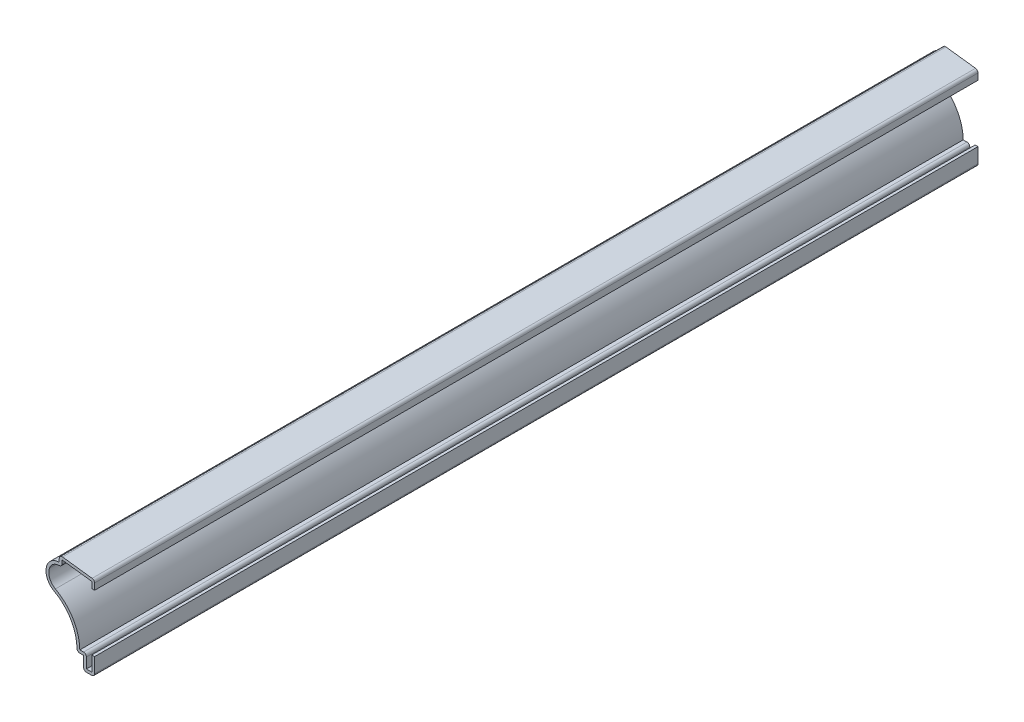
ISO-10303-21;
HEADER;
FILE_DESCRIPTION(('STEP AP214'),'2;1');
FILE_NAME('part.step','',(''),(''),'','','');
FILE_SCHEMA(('AUTOMOTIVE_DESIGN { 1 0 10303 214 1 1 1 1 }'));
ENDSEC;
DATA;
#1=APPLICATION_CONTEXT('core data for automotive mechanical design processes');
#2=APPLICATION_PROTOCOL_DEFINITION('international standard','automotive_design',2000,#1);
#3=PRODUCT_CONTEXT('',#1,'mechanical');
#4=PRODUCT('Part','Part','',(#3));
#5=PRODUCT_RELATED_PRODUCT_CATEGORY('part','',(#4));
#6=PRODUCT_DEFINITION_FORMATION('','',#4);
#7=PRODUCT_DEFINITION_CONTEXT('part definition',#1,'design');
#8=PRODUCT_DEFINITION('design','',#6,#7);
#9=PRODUCT_DEFINITION_SHAPE('','',#8);
#10=(LENGTH_UNIT() NAMED_UNIT(*) SI_UNIT(.MILLI.,.METRE.));
#11=(NAMED_UNIT(*) PLANE_ANGLE_UNIT() SI_UNIT($,.RADIAN.));
#12=(NAMED_UNIT(*) SI_UNIT($,.STERADIAN.) SOLID_ANGLE_UNIT());
#13=UNCERTAINTY_MEASURE_WITH_UNIT(LENGTH_MEASURE(1.E-05),#10,'distance_accuracy_value','');
#14=(GEOMETRIC_REPRESENTATION_CONTEXT(3) GLOBAL_UNCERTAINTY_ASSIGNED_CONTEXT((#13)) GLOBAL_UNIT_ASSIGNED_CONTEXT((#10,
#11,#12)) REPRESENTATION_CONTEXT('',''));
#15=CARTESIAN_POINT('',(0.,0.,0.));
#16=DIRECTION('',(0.,0.,1.));
#17=DIRECTION('',(1.,0.,0.));
#18=AXIS2_PLACEMENT_3D('',#15,#16,#17);
#19=CARTESIAN_POINT('',(-1.016,30.1625,-317.5));
#20=DIRECTION('',(-1.,0.,0.));
#21=DIRECTION('',(0.,-1.,0.));
#22=AXIS2_PLACEMENT_3D('',#19,#20,#21);
#23=PLANE('',#22);
#24=DIRECTION('',(0.,-1.,0.));
#25=VECTOR('',#24,1.);
#26=CARTESIAN_POINT('',(-1.016,30.1625,0.));
#27=LINE('',#26,#25);
#28=CARTESIAN_POINT('',(-1.016,29.2655932659661,0.));
#29=VERTEX_POINT('',#28);
#30=CARTESIAN_POINT('',(-1.016,26.9875,0.));
#31=VERTEX_POINT('',#30);
#32=EDGE_CURVE('E305',#29,#31,#27,.T.);
#33=ORIENTED_EDGE('',*,*,#32,.F.);
#34=DIRECTION('',(0.,0.,1.));
#35=VECTOR('',#34,1.);
#36=CARTESIAN_POINT('',(-1.016,29.2655932659661,-317.5));
#37=LINE('',#36,#35);
#38=CARTESIAN_POINT('',(-1.016,29.2655932659661,-317.5));
#39=VERTEX_POINT('',#38);
#40=EDGE_CURVE('E251',#39,#29,#37,.T.);
#41=ORIENTED_EDGE('',*,*,#40,.F.);
#42=DIRECTION('',(0.,-1.,0.));
#43=VECTOR('',#42,1.);
#44=CARTESIAN_POINT('',(-1.016,30.1625,-317.5));
#45=LINE('',#44,#43);
#46=CARTESIAN_POINT('',(-1.016,26.9875,-317.5));
#47=VERTEX_POINT('',#46);
#48=EDGE_CURVE('E233',#39,#47,#45,.T.);
#49=ORIENTED_EDGE('',*,*,#48,.T.);
#50=DIRECTION('',(0.,0.,1.));
#51=VECTOR('',#50,1.);
#52=CARTESIAN_POINT('',(-1.016,26.9875,-317.5));
#53=LINE('',#52,#51);
#54=EDGE_CURVE('E241',#47,#31,#53,.T.);
#55=ORIENTED_EDGE('',*,*,#54,.T.);
#56=EDGE_LOOP('',(#33,#41,#49,#55));
#57=FACE_BOUND('',#56,.T.);
#58=ADVANCED_FACE('F35',(#57),#23,.T.);
#59=CARTESIAN_POINT('',(-12.8260192903426,30.7418456772589,-317.5));
#60=DIRECTION('',(-0.124034734589208,-0.992277876713668,0.));
#61=DIRECTION('',(0.992277876713668,-0.124034734589208,0.));
#62=AXIS2_PLACEMENT_3D('',#59,#60,#61);
#63=PLANE('',#62);
#64=DIRECTION('',(0.992277876713668,-0.124034734589208,0.));
#65=VECTOR('',#64,1.);
#66=CARTESIAN_POINT('',(-12.8260192903426,30.7418456772589,0.));
#67=LINE('',#66,#65);
#68=CARTESIAN_POINT('',(-11.684,30.5990932659661,0.));
#69=VERTEX_POINT('',#68);
#70=EDGE_CURVE('E252',#69,#29,#67,.T.);
#71=ORIENTED_EDGE('',*,*,#70,.F.);
#72=DIRECTION('',(0.,0.,1.));
#73=VECTOR('',#72,1.);
#74=CARTESIAN_POINT('',(-11.684,30.5990932659661,-317.5));
#75=LINE('',#74,#73);
#76=CARTESIAN_POINT('',(-11.684,30.5990932659661,-317.5));
#77=VERTEX_POINT('',#76);
#78=EDGE_CURVE('E357',#77,#69,#75,.T.);
#79=ORIENTED_EDGE('',*,*,#78,.F.);
#80=DIRECTION('',(0.992277876713668,-0.124034734589208,0.));
#81=VECTOR('',#80,1.);
#82=CARTESIAN_POINT('',(-12.8260192903426,30.7418456772589,-317.5));
#83=LINE('',#82,#81);
#84=EDGE_CURVE('E249',#77,#39,#83,.T.);
#85=ORIENTED_EDGE('',*,*,#84,.T.);
#86=ORIENTED_EDGE('',*,*,#40,.T.);
#87=EDGE_LOOP('',(#71,#79,#85,#86));
#88=FACE_BOUND('',#87,.T.);
#89=ADVANCED_FACE('F468',(#88),#63,.T.);
#90=CARTESIAN_POINT('',(-11.684,29.36875,-317.5));
#91=DIRECTION('',(1.,0.,0.));
#92=DIRECTION('',(0.,1.,0.));
#93=AXIS2_PLACEMENT_3D('',#90,#91,#92);
#94=PLANE('',#93);
#95=DIRECTION('',(0.,1.,0.));
#96=VECTOR('',#95,1.);
#97=CARTESIAN_POINT('',(-11.684,29.36875,0.));
#98=LINE('',#97,#96);
#99=CARTESIAN_POINT('',(-11.684,29.36875,0.));
#100=VERTEX_POINT('',#99);
#101=EDGE_CURVE('E255',#100,#69,#98,.T.);
#102=ORIENTED_EDGE('',*,*,#101,.F.);
#103=DIRECTION('',(0.,0.,1.));
#104=VECTOR('',#103,1.);
#105=CARTESIAN_POINT('',(-11.684,29.36875,-317.5));
#106=LINE('',#105,#104);
#107=CARTESIAN_POINT('',(-11.684,29.36875,-317.5));
#108=VERTEX_POINT('',#107);
#109=EDGE_CURVE('E438',#100,#108,#106,.F.);
#110=ORIENTED_EDGE('',*,*,#109,.T.);
#111=DIRECTION('',(0.,1.,0.));
#112=VECTOR('',#111,1.);
#113=CARTESIAN_POINT('',(-11.684,29.36875,-317.5));
#114=LINE('',#113,#112);
#115=EDGE_CURVE('E302',#108,#77,#114,.T.);
#116=ORIENTED_EDGE('',*,*,#115,.T.);
#117=ORIENTED_EDGE('',*,*,#78,.T.);
#118=EDGE_LOOP('',(#102,#110,#116,#117));
#119=FACE_BOUND('',#118,.T.);
#120=ADVANCED_FACE('F570',(#119),#94,.T.);
#121=CARTESIAN_POINT('',(-12.6576725735811,24.6064380993605,-317.5));
#122=DIRECTION('',(0.,0.,1.));
#123=DIRECTION('',(1.,0.,0.));
#124=AXIS2_PLACEMENT_3D('',#121,#122,#123);
#125=CYLINDRICAL_SURFACE('',#124,3.7465);
#126=CARTESIAN_POINT('',(-12.6576725735811,24.6064380993605,-317.5));
#127=DIRECTION('',(0.,0.,1.));
#128=DIRECTION('',(1.,0.,0.));
#129=AXIS2_PLACEMENT_3D('',#126,#127,#128);
#130=CIRCLE('',#129,3.7465);
#131=CARTESIAN_POINT('',(-16.2043871208838,25.8135330293272,-317.5));
#132=VERTEX_POINT('',#131);
#133=CARTESIAN_POINT('',(-12.6909701490306,28.3527901278636,-317.5));
#134=VERTEX_POINT('',#133);
#135=EDGE_CURVE('E299',#132,#134,#130,.F.);
#136=ORIENTED_EDGE('',*,*,#135,.T.);
#137=DIRECTION('',(0.,0.,1.));
#138=VECTOR('',#137,1.);
#139=CARTESIAN_POINT('',(-12.6909701490306,28.3527901278636,-317.5));
#140=LINE('',#139,#138);
#141=CARTESIAN_POINT('',(-12.6909701490306,28.3527901278636,0.));
#142=VERTEX_POINT('',#141);
#143=EDGE_CURVE('E435',#134,#142,#140,.T.);
#144=ORIENTED_EDGE('',*,*,#143,.T.);
#145=CARTESIAN_POINT('',(-12.6576725735811,24.6064380993605,0.));
#146=DIRECTION('',(0.,0.,1.));
#147=DIRECTION('',(1.,0.,0.));
#148=AXIS2_PLACEMENT_3D('',#145,#146,#147);
#149=CIRCLE('',#148,3.7465);
#150=CARTESIAN_POINT('',(-16.2043871208838,25.8135330293272,0.));
#151=VERTEX_POINT('',#150);
#152=EDGE_CURVE('E351',#151,#142,#149,.F.);
#153=ORIENTED_EDGE('',*,*,#152,.F.);
#154=DIRECTION('',(0.,0.,1.));
#155=VECTOR('',#154,1.);
#156=CARTESIAN_POINT('',(-16.2043871208838,25.8135330293272,-317.5));
#157=LINE('',#156,#155);
#158=EDGE_CURVE('E360',#132,#151,#157,.T.);
#159=ORIENTED_EDGE('',*,*,#158,.F.);
#160=EDGE_LOOP('',(#136,#144,#153,#159));
#161=FACE_BOUND('',#160,.T.);
#162=ADVANCED_FACE('F479',(#161),#125,.F.);
#163=CARTESIAN_POINT('',(-11.90625,24.3506976480963,-317.5));
#164=DIRECTION('',(0.,0.,1.));
#165=DIRECTION('',(1.,0.,0.));
#166=AXIS2_PLACEMENT_3D('',#163,#164,#165);
#167=CYLINDRICAL_SURFACE('',#166,4.54025);
#168=CARTESIAN_POINT('',(-11.90625,24.3506976480963,0.));
#169=DIRECTION('',(0.,0.,1.));
#170=DIRECTION('',(1.,0.,0.));
#171=AXIS2_PLACEMENT_3D('',#168,#169,#170);
#172=CIRCLE('',#171,4.54025);
#173=CARTESIAN_POINT('',(-14.0880897303622,20.3690591093145,0.));
#174=VERTEX_POINT('',#173);
#175=EDGE_CURVE('E348',#174,#151,#172,.F.);
#176=ORIENTED_EDGE('',*,*,#175,.F.);
#177=DIRECTION('',(0.,0.,1.));
#178=VECTOR('',#177,1.);
#179=CARTESIAN_POINT('',(-14.0880897303622,20.3690591093145,-317.5));
#180=LINE('',#179,#178);
#181=CARTESIAN_POINT('',(-14.0880897303622,20.3690591093145,-317.5));
#182=VERTEX_POINT('',#181);
#183=EDGE_CURVE('E362',#182,#174,#180,.T.);
#184=ORIENTED_EDGE('',*,*,#183,.F.);
#185=CARTESIAN_POINT('',(-11.90625,24.3506976480963,-317.5));
#186=DIRECTION('',(0.,0.,1.));
#187=DIRECTION('',(1.,0.,0.));
#188=AXIS2_PLACEMENT_3D('',#185,#186,#187);
#189=CIRCLE('',#188,4.54025);
#190=EDGE_CURVE('E296',#182,#132,#189,.F.);
#191=ORIENTED_EDGE('',*,*,#190,.T.);
#192=ORIENTED_EDGE('',*,*,#158,.T.);
#193=EDGE_LOOP('',(#176,#184,#191,#192));
#194=FACE_BOUND('',#193,.T.);
#195=ADVANCED_FACE('F483',(#194),#167,.F.);
#196=CARTESIAN_POINT('',(-22.2051438321291,5.55625,-317.5));
#197=DIRECTION('',(0.,0.,1.));
#198=DIRECTION('',(1.,0.,0.));
#199=AXIS2_PLACEMENT_3D('',#196,#197,#198);
#200=CYLINDRICAL_SURFACE('',#199,16.891);
#201=CARTESIAN_POINT('',(-22.2051438321291,5.55625,0.));
#202=DIRECTION('',(0.,0.,1.));
#203=DIRECTION('',(1.,0.,0.));
#204=AXIS2_PLACEMENT_3D('',#201,#202,#203);
#205=CIRCLE('',#204,16.891);
#206=CARTESIAN_POINT('',(-5.31560606647366,5.7785,0.));
#207=VERTEX_POINT('',#206);
#208=EDGE_CURVE('E345',#207,#174,#205,.T.);
#209=ORIENTED_EDGE('',*,*,#208,.F.);
#210=DIRECTION('',(0.,0.,1.));
#211=VECTOR('',#210,1.);
#212=CARTESIAN_POINT('',(-5.31560606647366,5.7785,-317.5));
#213=LINE('',#212,#211);
#214=CARTESIAN_POINT('',(-5.31560606647366,5.7785,-317.5));
#215=VERTEX_POINT('',#214);
#216=EDGE_CURVE('E364',#215,#207,#213,.T.);
#217=ORIENTED_EDGE('',*,*,#216,.F.);
#218=CARTESIAN_POINT('',(-22.2051438321291,5.55625,-317.5));
#219=DIRECTION('',(0.,0.,1.));
#220=DIRECTION('',(1.,0.,0.));
#221=AXIS2_PLACEMENT_3D('',#218,#219,#220);
#222=CIRCLE('',#221,16.891);
#223=EDGE_CURVE('E293',#215,#182,#222,.T.);
#224=ORIENTED_EDGE('',*,*,#223,.T.);
#225=ORIENTED_EDGE('',*,*,#183,.T.);
#226=EDGE_LOOP('',(#209,#217,#224,#225));
#227=FACE_BOUND('',#226,.T.);
#228=ADVANCED_FACE('F489',(#227),#200,.T.);
#229=CARTESIAN_POINT('',(-3.96875,5.7785,-317.5));
#230=DIRECTION('',(0.,1.,0.));
#231=DIRECTION('',(0.,0.,1.));
#232=AXIS2_PLACEMENT_3D('',#229,#230,#231);
#233=PLANE('',#232);
#234=DIRECTION('',(1.,0.,0.));
#235=VECTOR('',#234,1.);
#236=CARTESIAN_POINT('',(-3.96875,5.7785,0.));
#237=LINE('',#236,#235);
#238=CARTESIAN_POINT('',(-3.96875,5.7785,0.));
#239=VERTEX_POINT('',#238);
#240=EDGE_CURVE('E343',#239,#207,#237,.F.);
#241=ORIENTED_EDGE('',*,*,#240,.F.);
#242=DIRECTION('',(0.,0.,1.));
#243=VECTOR('',#242,1.);
#244=CARTESIAN_POINT('',(-3.96875,5.7785,-317.5));
#245=LINE('',#244,#243);
#246=CARTESIAN_POINT('',(-3.96875,5.7785,-317.5));
#247=VERTEX_POINT('',#246);
#248=EDGE_CURVE('E433',#239,#247,#245,.F.);
#249=ORIENTED_EDGE('',*,*,#248,.T.);
#250=DIRECTION('',(1.,0.,0.));
#251=VECTOR('',#250,1.);
#252=CARTESIAN_POINT('',(-3.96875,5.7785,-317.5));
#253=LINE('',#252,#251);
#254=EDGE_CURVE('E291',#247,#215,#253,.F.);
#255=ORIENTED_EDGE('',*,*,#254,.T.);
#256=ORIENTED_EDGE('',*,*,#216,.T.);
#257=EDGE_LOOP('',(#241,#249,#255,#256));
#258=FACE_BOUND('',#257,.T.);
#259=ADVANCED_FACE('F492',(#258),#233,.T.);
#260=CARTESIAN_POINT('',(-2.95275,0.,-317.5));
#261=DIRECTION('',(1.,0.,0.));
#262=DIRECTION('',(0.,0.,-1.));
#263=AXIS2_PLACEMENT_3D('',#260,#261,#262);
#264=PLANE('',#263);
#265=DIRECTION('',(0.,1.,0.));
#266=VECTOR('',#265,1.);
#267=CARTESIAN_POINT('',(-2.95275,0.,-317.5));
#268=LINE('',#267,#266);
#269=CARTESIAN_POINT('',(-2.95275,1.016,-317.5));
#270=VERTEX_POINT('',#269);
#271=CARTESIAN_POINT('',(-2.95275,4.7625,-317.5));
#272=VERTEX_POINT('',#271);
#273=EDGE_CURVE('E288',#270,#272,#268,.T.);
#274=ORIENTED_EDGE('',*,*,#273,.T.);
#275=DIRECTION('',(0.,0.,1.));
#276=VECTOR('',#275,1.);
#277=CARTESIAN_POINT('',(-2.95275,4.7625,-317.5));
#278=LINE('',#277,#276);
#279=CARTESIAN_POINT('',(-2.95275,4.7625,0.));
#280=VERTEX_POINT('',#279);
#281=EDGE_CURVE('E430',#272,#280,#278,.T.);
#282=ORIENTED_EDGE('',*,*,#281,.T.);
#283=DIRECTION('',(0.,1.,0.));
#284=VECTOR('',#283,1.);
#285=CARTESIAN_POINT('',(-2.95275,0.,0.));
#286=LINE('',#285,#284);
#287=CARTESIAN_POINT('',(-2.95275,1.016,0.));
#288=VERTEX_POINT('',#287);
#289=EDGE_CURVE('E340',#288,#280,#286,.T.);
#290=ORIENTED_EDGE('',*,*,#289,.F.);
#291=DIRECTION('',(0.,0.,1.));
#292=VECTOR('',#291,1.);
#293=CARTESIAN_POINT('',(-2.95275,1.016,-317.5));
#294=LINE('',#293,#292);
#295=EDGE_CURVE('E367',#270,#288,#294,.T.);
#296=ORIENTED_EDGE('',*,*,#295,.F.);
#297=EDGE_LOOP('',(#274,#282,#290,#296));
#298=FACE_BOUND('',#297,.T.);
#299=ADVANCED_FACE('F501',(#298),#264,.T.);
#300=CARTESIAN_POINT('',(0.,1.016,-317.5));
#301=DIRECTION('',(0.,1.,0.));
#302=DIRECTION('',(-1.,0.,0.));
#303=AXIS2_PLACEMENT_3D('',#300,#301,#302);
#304=PLANE('',#303);
#305=DIRECTION('',(-1.,0.,0.));
#306=VECTOR('',#305,1.);
#307=CARTESIAN_POINT('',(0.,1.016,0.));
#308=LINE('',#307,#306);
#309=CARTESIAN_POINT('',(-1.016,1.016,0.));
#310=VERTEX_POINT('',#309);
#311=EDGE_CURVE('E337',#310,#288,#308,.T.);
#312=ORIENTED_EDGE('',*,*,#311,.F.);
#313=DIRECTION('',(0.,0.,1.));
#314=VECTOR('',#313,1.);
#315=CARTESIAN_POINT('',(-1.016,1.016,-317.5));
#316=LINE('',#315,#314);
#317=CARTESIAN_POINT('',(-1.016,1.016,-317.5));
#318=VERTEX_POINT('',#317);
#319=EDGE_CURVE('E369',#318,#310,#316,.T.);
#320=ORIENTED_EDGE('',*,*,#319,.F.);
#321=DIRECTION('',(-1.,0.,0.));
#322=VECTOR('',#321,1.);
#323=CARTESIAN_POINT('',(0.,1.016,-317.5));
#324=LINE('',#323,#322);
#325=EDGE_CURVE('E285',#318,#270,#324,.T.);
#326=ORIENTED_EDGE('',*,*,#325,.T.);
#327=ORIENTED_EDGE('',*,*,#295,.T.);
#328=EDGE_LOOP('',(#312,#320,#326,#327));
#329=FACE_BOUND('',#328,.T.);
#330=ADVANCED_FACE('F506',(#329),#304,.T.);
#331=CARTESIAN_POINT('',(-1.016,6.35,-317.5));
#332=DIRECTION('',(-1.,0.,0.));
#333=DIRECTION('',(0.,-1.,0.));
#334=AXIS2_PLACEMENT_3D('',#331,#332,#333);
#335=PLANE('',#334);
#336=DIRECTION('',(0.,-1.,0.));
#337=VECTOR('',#336,1.);
#338=CARTESIAN_POINT('',(-1.016,6.35,0.));
#339=LINE('',#338,#337);
#340=CARTESIAN_POINT('',(-1.016,6.35,0.));
#341=VERTEX_POINT('',#340);
#342=EDGE_CURVE('E334',#341,#310,#339,.T.);
#343=ORIENTED_EDGE('',*,*,#342,.F.);
#344=DIRECTION('',(0.,0.,1.));
#345=VECTOR('',#344,1.);
#346=CARTESIAN_POINT('',(-1.016,6.35,-317.5));
#347=LINE('',#346,#345);
#348=CARTESIAN_POINT('',(-1.016,6.35,-317.5));
#349=VERTEX_POINT('',#348);
#350=EDGE_CURVE('E371',#349,#341,#347,.T.);
#351=ORIENTED_EDGE('',*,*,#350,.F.);
#352=DIRECTION('',(0.,-1.,0.));
#353=VECTOR('',#352,1.);
#354=CARTESIAN_POINT('',(-1.016,6.35,-317.5));
#355=LINE('',#354,#353);
#356=EDGE_CURVE('E282',#349,#318,#355,.T.);
#357=ORIENTED_EDGE('',*,*,#356,.T.);
#358=ORIENTED_EDGE('',*,*,#319,.T.);
#359=EDGE_LOOP('',(#343,#351,#357,#358));
#360=FACE_BOUND('',#359,.T.);
#361=ADVANCED_FACE('F510',(#360),#335,.T.);
#362=CARTESIAN_POINT('',(-1.016,6.35,-317.5));
#363=DIRECTION('',(0.,-1.,0.));
#364=DIRECTION('',(0.,0.,-1.));
#365=AXIS2_PLACEMENT_3D('',#362,#363,#364);
#366=PLANE('',#365);
#367=DIRECTION('',(1.,0.,0.));
#368=VECTOR('',#367,1.);
#369=CARTESIAN_POINT('',(-1.016,6.35,0.));
#370=LINE('',#369,#368);
#371=CARTESIAN_POINT('',(0.,6.35,0.));
#372=VERTEX_POINT('',#371);
#373=EDGE_CURVE('E332',#341,#372,#370,.T.);
#374=ORIENTED_EDGE('',*,*,#373,.T.);
#375=DIRECTION('',(0.,0.,1.));
#376=VECTOR('',#375,1.);
#377=CARTESIAN_POINT('',(0.,6.35,-317.5));
#378=LINE('',#377,#376);
#379=CARTESIAN_POINT('',(0.,6.35,-317.5));
#380=VERTEX_POINT('',#379);
#381=EDGE_CURVE('E373',#380,#372,#378,.T.);
#382=ORIENTED_EDGE('',*,*,#381,.F.);
#383=DIRECTION('',(1.,0.,0.));
#384=VECTOR('',#383,1.);
#385=CARTESIAN_POINT('',(-1.016,6.35,-317.5));
#386=LINE('',#385,#384);
#387=EDGE_CURVE('E280',#349,#380,#386,.T.);
#388=ORIENTED_EDGE('',*,*,#387,.F.);
#389=ORIENTED_EDGE('',*,*,#350,.T.);
#390=EDGE_LOOP('',(#374,#382,#388,#389));
#391=FACE_BOUND('',#390,.T.);
#392=ADVANCED_FACE('F514',(#391),#366,.F.);
#393=CARTESIAN_POINT('',(0.,6.35,-317.5));
#394=DIRECTION('',(-1.,0.,0.));
#395=DIRECTION('',(0.,-1.,0.));
#396=AXIS2_PLACEMENT_3D('',#393,#394,#395);
#397=PLANE('',#396);
#398=DIRECTION('',(0.,-1.,0.));
#399=VECTOR('',#398,1.);
#400=CARTESIAN_POINT('',(0.,6.35,0.));
#401=LINE('',#400,#399);
#402=CARTESIAN_POINT('',(0.,1.016,0.));
#403=VERTEX_POINT('',#402);
#404=EDGE_CURVE('E329',#372,#403,#401,.T.);
#405=ORIENTED_EDGE('',*,*,#404,.T.);
#406=DIRECTION('',(0.,0.,1.));
#407=VECTOR('',#406,1.);
#408=CARTESIAN_POINT('',(0.,1.016,-317.5));
#409=LINE('',#408,#407);
#410=CARTESIAN_POINT('',(0.,1.016,-317.5));
#411=VERTEX_POINT('',#410);
#412=EDGE_CURVE('E425',#403,#411,#409,.F.);
#413=ORIENTED_EDGE('',*,*,#412,.T.);
#414=DIRECTION('',(0.,-1.,0.));
#415=VECTOR('',#414,1.);
#416=CARTESIAN_POINT('',(0.,6.35,-317.5));
#417=LINE('',#416,#415);
#418=EDGE_CURVE('E277',#380,#411,#417,.T.);
#419=ORIENTED_EDGE('',*,*,#418,.F.);
#420=ORIENTED_EDGE('',*,*,#381,.T.);
#421=EDGE_LOOP('',(#405,#413,#419,#420));
#422=FACE_BOUND('',#421,.T.);
#423=ADVANCED_FACE('F700',(#422),#397,.F.);
#424=CARTESIAN_POINT('',(0.,0.,-317.5));
#425=DIRECTION('',(0.,1.,0.));
#426=DIRECTION('',(-1.,0.,0.));
#427=AXIS2_PLACEMENT_3D('',#424,#425,#426);
#428=PLANE('',#427);
#429=DIRECTION('',(-1.,0.,0.));
#430=VECTOR('',#429,1.);
#431=CARTESIAN_POINT('',(0.,0.,-317.5));
#432=LINE('',#431,#430);
#433=CARTESIAN_POINT('',(-1.016,0.,-317.5));
#434=VERTEX_POINT('',#433);
#435=CARTESIAN_POINT('',(-2.95275,0.,-317.5));
#436=VERTEX_POINT('',#435);
#437=EDGE_CURVE('E274',#434,#436,#432,.T.);
#438=ORIENTED_EDGE('',*,*,#437,.F.);
#439=DIRECTION('',(0.,0.,1.));
#440=VECTOR('',#439,1.);
#441=CARTESIAN_POINT('',(-1.016,0.,-317.5));
#442=LINE('',#441,#440);
#443=CARTESIAN_POINT('',(-1.016,0.,0.));
#444=VERTEX_POINT('',#443);
#445=EDGE_CURVE('E422',#434,#444,#442,.T.);
#446=ORIENTED_EDGE('',*,*,#445,.T.);
#447=DIRECTION('',(-1.,0.,0.));
#448=VECTOR('',#447,1.);
#449=CARTESIAN_POINT('',(0.,0.,0.));
#450=LINE('',#449,#448);
#451=CARTESIAN_POINT('',(-2.95275,0.,0.));
#452=VERTEX_POINT('',#451);
#453=EDGE_CURVE('E326',#444,#452,#450,.T.);
#454=ORIENTED_EDGE('',*,*,#453,.T.);
#455=DIRECTION('',(0.,0.,1.));
#456=VECTOR('',#455,1.);
#457=CARTESIAN_POINT('',(-2.95275,0.,-317.5));
#458=LINE('',#457,#456);
#459=EDGE_CURVE('E420',#452,#436,#458,.F.);
#460=ORIENTED_EDGE('',*,*,#459,.T.);
#461=EDGE_LOOP('',(#438,#446,#454,#460));
#462=FACE_BOUND('',#461,.T.);
#463=ADVANCED_FACE('F525',(#462),#428,.F.);
#464=CARTESIAN_POINT('',(-3.96875,0.,-317.5));
#465=DIRECTION('',(1.,0.,0.));
#466=DIRECTION('',(0.,0.,-1.));
#467=AXIS2_PLACEMENT_3D('',#464,#465,#466);
#468=PLANE('',#467);
#469=DIRECTION('',(0.,1.,0.));
#470=VECTOR('',#469,1.);
#471=CARTESIAN_POINT('',(-3.96875,0.,-317.5));
#472=LINE('',#471,#470);
#473=CARTESIAN_POINT('',(-3.96875,1.016,-317.5));
#474=VERTEX_POINT('',#473);
#475=CARTESIAN_POINT('',(-3.96875,4.7625,-317.5));
#476=VERTEX_POINT('',#475);
#477=EDGE_CURVE('E272',#474,#476,#472,.T.);
#478=ORIENTED_EDGE('',*,*,#477,.F.);
#479=DIRECTION('',(0.,0.,1.));
#480=VECTOR('',#479,1.);
#481=CARTESIAN_POINT('',(-3.96875,1.016,-317.5));
#482=LINE('',#481,#480);
#483=CARTESIAN_POINT('',(-3.96875,1.016,0.));
#484=VERTEX_POINT('',#483);
#485=EDGE_CURVE('E427',#474,#484,#482,.T.);
#486=ORIENTED_EDGE('',*,*,#485,.T.);
#487=DIRECTION('',(0.,1.,0.));
#488=VECTOR('',#487,1.);
#489=CARTESIAN_POINT('',(-3.96875,0.,0.));
#490=LINE('',#489,#488);
#491=CARTESIAN_POINT('',(-3.96875,4.7625,0.));
#492=VERTEX_POINT('',#491);
#493=EDGE_CURVE('E324',#484,#492,#490,.T.);
#494=ORIENTED_EDGE('',*,*,#493,.T.);
#495=DIRECTION('',(0.,0.,1.));
#496=VECTOR('',#495,1.);
#497=CARTESIAN_POINT('',(-3.96875,4.7625,-317.5));
#498=LINE('',#497,#496);
#499=EDGE_CURVE('E376',#476,#492,#498,.T.);
#500=ORIENTED_EDGE('',*,*,#499,.F.);
#501=EDGE_LOOP('',(#478,#486,#494,#500));
#502=FACE_BOUND('',#501,.T.);
#503=ADVANCED_FACE('F536',(#502),#468,.F.);
#504=CARTESIAN_POINT('',(-3.96875,4.7625,-317.5));
#505=DIRECTION('',(0.,1.,0.));
#506=DIRECTION('',(0.,0.,1.));
#507=AXIS2_PLACEMENT_3D('',#504,#505,#506);
#508=PLANE('',#507);
#509=DIRECTION('',(-1.,0.,0.));
#510=VECTOR('',#509,1.);
#511=CARTESIAN_POINT('',(-3.96875,4.7625,0.));
#512=LINE('',#511,#510);
#513=CARTESIAN_POINT('',(-5.31560606647366,4.7625,0.));
#514=VERTEX_POINT('',#513);
#515=EDGE_CURVE('E321',#492,#514,#512,.T.);
#516=ORIENTED_EDGE('',*,*,#515,.T.);
#517=DIRECTION('',(0.,0.,1.));
#518=VECTOR('',#517,1.);
#519=CARTESIAN_POINT('',(-5.31560606647366,4.7625,-317.5));
#520=LINE('',#519,#518);
#521=CARTESIAN_POINT('',(-5.31560606647366,4.7625,-317.5));
#522=VERTEX_POINT('',#521);
#523=EDGE_CURVE('E405',#514,#522,#520,.F.);
#524=ORIENTED_EDGE('',*,*,#523,.T.);
#525=DIRECTION('',(-1.,0.,0.));
#526=VECTOR('',#525,1.);
#527=CARTESIAN_POINT('',(-3.96875,4.7625,-317.5));
#528=LINE('',#527,#526);
#529=EDGE_CURVE('E270',#476,#522,#528,.T.);
#530=ORIENTED_EDGE('',*,*,#529,.F.);
#531=ORIENTED_EDGE('',*,*,#499,.T.);
#532=EDGE_LOOP('',(#516,#524,#530,#531));
#533=FACE_BOUND('',#532,.T.);
#534=ADVANCED_FACE('F674',(#533),#508,.F.);
#535=CARTESIAN_POINT('',(-22.2051438321291,5.55625,-317.5));
#536=DIRECTION('',(0.,0.,1.));
#537=DIRECTION('',(1.,0.,0.));
#538=AXIS2_PLACEMENT_3D('',#535,#536,#537);
#539=CYLINDRICAL_SURFACE('',#538,15.875);
#540=CARTESIAN_POINT('',(-22.2051438321291,5.55625,-317.5));
#541=DIRECTION('',(0.,0.,1.));
#542=DIRECTION('',(1.,0.,0.));
#543=AXIS2_PLACEMENT_3D('',#540,#541,#542);
#544=CIRCLE('',#543,15.875);
#545=CARTESIAN_POINT('',(-6.33151811252812,5.76513157894737,-317.5));
#546=VERTEX_POINT('',#545);
#547=CARTESIAN_POINT('',(-14.5763335861075,19.478063072664,-317.5));
#548=VERTEX_POINT('',#547);
#549=EDGE_CURVE('E268',#546,#548,#544,.T.);
#550=ORIENTED_EDGE('',*,*,#549,.F.);
#551=DIRECTION('',(0.,0.,1.));
#552=VECTOR('',#551,1.);
#553=CARTESIAN_POINT('',(-6.33151811252812,5.76513157894737,-317.5));
#554=LINE('',#553,#552);
#555=CARTESIAN_POINT('',(-6.33151811252812,5.76513157894737,0.));
#556=VERTEX_POINT('',#555);
#557=EDGE_CURVE('E356',#546,#556,#554,.T.);
#558=ORIENTED_EDGE('',*,*,#557,.T.);
#559=CARTESIAN_POINT('',(-22.2051438321291,5.55625,0.));
#560=DIRECTION('',(0.,0.,1.));
#561=DIRECTION('',(1.,0.,0.));
#562=AXIS2_PLACEMENT_3D('',#559,#560,#561);
#563=CIRCLE('',#562,15.875);
#564=CARTESIAN_POINT('',(-14.5763335861075,19.478063072664,0.));
#565=VERTEX_POINT('',#564);
#566=EDGE_CURVE('E319',#556,#565,#563,.T.);
#567=ORIENTED_EDGE('',*,*,#566,.T.);
#568=DIRECTION('',(0.,0.,1.));
#569=VECTOR('',#568,1.);
#570=CARTESIAN_POINT('',(-14.5763335861075,19.478063072664,-317.5));
#571=LINE('',#570,#569);
#572=EDGE_CURVE('E379',#548,#565,#571,.T.);
#573=ORIENTED_EDGE('',*,*,#572,.F.);
#574=EDGE_LOOP('',(#550,#558,#567,#573));
#575=FACE_BOUND('',#574,.T.);
#576=ADVANCED_FACE('F547',(#575),#539,.F.);
#577=CARTESIAN_POINT('',(-11.90625,24.3506976480963,-317.5));
#578=DIRECTION('',(0.,0.,1.));
#579=DIRECTION('',(1.,0.,0.));
#580=AXIS2_PLACEMENT_3D('',#577,#578,#579);
#581=CYLINDRICAL_SURFACE('',#580,5.55625);
#582=CARTESIAN_POINT('',(-11.90625,24.3506976480963,0.));
#583=DIRECTION('',(0.,0.,-1.));
#584=DIRECTION('',(1.,0.,0.));
#585=AXIS2_PLACEMENT_3D('',#582,#583,#584);
#586=CIRCLE('',#585,5.55625);
#587=CARTESIAN_POINT('',(-17.1662080150675,26.1408808069454,0.));
#588=VERTEX_POINT('',#587);
#589=EDGE_CURVE('E317',#565,#588,#586,.T.);
#590=ORIENTED_EDGE('',*,*,#589,.T.);
#591=DIRECTION('',(0.,0.,1.));
#592=VECTOR('',#591,1.);
#593=CARTESIAN_POINT('',(-17.1662080150675,26.1408808069454,-317.5));
#594=LINE('',#593,#592);
#595=CARTESIAN_POINT('',(-17.1662080150675,26.1408808069454,-317.5));
#596=VERTEX_POINT('',#595);
#597=EDGE_CURVE('E382',#596,#588,#594,.T.);
#598=ORIENTED_EDGE('',*,*,#597,.F.);
#599=CARTESIAN_POINT('',(-11.90625,24.3506976480963,-317.5));
#600=DIRECTION('',(0.,0.,-1.));
#601=DIRECTION('',(1.,0.,0.));
#602=AXIS2_PLACEMENT_3D('',#599,#600,#601);
#603=CIRCLE('',#602,5.55625);
#604=EDGE_CURVE('E266',#548,#596,#603,.T.);
#605=ORIENTED_EDGE('',*,*,#604,.F.);
#606=ORIENTED_EDGE('',*,*,#572,.T.);
#607=EDGE_LOOP('',(#590,#598,#605,#606));
#608=FACE_BOUND('',#607,.T.);
#609=ADVANCED_FACE('F553',(#608),#581,.T.);
#610=CARTESIAN_POINT('',(-12.6576725735811,24.6064380993605,-317.5));
#611=DIRECTION('',(0.,0.,1.));
#612=DIRECTION('',(1.,0.,0.));
#613=AXIS2_PLACEMENT_3D('',#610,#611,#612);
#614=CYLINDRICAL_SURFACE('',#613,4.7625);
#615=CARTESIAN_POINT('',(-12.6576725735811,24.6064380993605,0.));
#616=DIRECTION('',(0.,0.,-1.));
#617=DIRECTION('',(1.,0.,0.));
#618=AXIS2_PLACEMENT_3D('',#615,#616,#617);
#619=CIRCLE('',#618,4.7625);
#620=CARTESIAN_POINT('',(-12.7,29.36875,0.));
#621=VERTEX_POINT('',#620);
#622=EDGE_CURVE('E315',#588,#621,#619,.T.);
#623=ORIENTED_EDGE('',*,*,#622,.T.);
#624=DIRECTION('',(0.,0.,1.));
#625=VECTOR('',#624,1.);
#626=CARTESIAN_POINT('',(-12.7,29.36875,-317.5));
#627=LINE('',#626,#625);
#628=CARTESIAN_POINT('',(-12.7,29.36875,-317.5));
#629=VERTEX_POINT('',#628);
#630=EDGE_CURVE('E385',#629,#621,#627,.T.);
#631=ORIENTED_EDGE('',*,*,#630,.F.);
#632=CARTESIAN_POINT('',(-12.6576725735811,24.6064380993605,-317.5));
#633=DIRECTION('',(0.,0.,-1.));
#634=DIRECTION('',(1.,0.,0.));
#635=AXIS2_PLACEMENT_3D('',#632,#633,#634);
#636=CIRCLE('',#635,4.7625);
#637=EDGE_CURVE('E264',#596,#629,#636,.T.);
#638=ORIENTED_EDGE('',*,*,#637,.F.);
#639=ORIENTED_EDGE('',*,*,#597,.T.);
#640=EDGE_LOOP('',(#623,#631,#638,#639));
#641=FACE_BOUND('',#640,.T.);
#642=ADVANCED_FACE('F556',(#641),#614,.T.);
#643=CARTESIAN_POINT('',(-12.7,29.36875,-317.5));
#644=DIRECTION('',(1.,0.,0.));
#645=DIRECTION('',(0.,1.,0.));
#646=AXIS2_PLACEMENT_3D('',#643,#644,#645);
#647=PLANE('',#646);
#648=DIRECTION('',(0.,1.,0.));
#649=VECTOR('',#648,1.);
#650=CARTESIAN_POINT('',(-12.7,29.36875,0.));
#651=LINE('',#650,#649);
#652=CARTESIAN_POINT('',(-12.7,30.5990932659661,0.));
#653=VERTEX_POINT('',#652);
#654=EDGE_CURVE('E312',#621,#653,#651,.T.);
#655=ORIENTED_EDGE('',*,*,#654,.T.);
#656=DIRECTION('',(0.,0.,1.));
#657=VECTOR('',#656,1.);
#658=CARTESIAN_POINT('',(-12.7,30.5990932659661,-317.5));
#659=LINE('',#658,#657);
#660=CARTESIAN_POINT('',(-12.7,30.5990932659661,-317.5));
#661=VERTEX_POINT('',#660);
#662=EDGE_CURVE('E43',#653,#661,#659,.F.);
#663=ORIENTED_EDGE('',*,*,#662,.T.);
#664=DIRECTION('',(0.,1.,0.));
#665=VECTOR('',#664,1.);
#666=CARTESIAN_POINT('',(-12.7,29.36875,-317.5));
#667=LINE('',#666,#665);
#668=EDGE_CURVE('E261',#629,#661,#667,.T.);
#669=ORIENTED_EDGE('',*,*,#668,.F.);
#670=ORIENTED_EDGE('',*,*,#630,.T.);
#671=EDGE_LOOP('',(#655,#663,#669,#670));
#672=FACE_BOUND('',#671,.T.);
#673=ADVANCED_FACE('F446',(#672),#647,.F.);
#674=CARTESIAN_POINT('',(-12.7,31.75,-317.5));
#675=DIRECTION('',(-0.124034734589208,-0.992277876713668,0.));
#676=DIRECTION('',(0.992277876713668,-0.124034734589208,0.));
#677=AXIS2_PLACEMENT_3D('',#674,#675,#676);
#678=PLANE('',#677);
#679=DIRECTION('',(0.992277876713668,-0.124034734589208,0.));
#680=VECTOR('',#679,1.);
#681=CARTESIAN_POINT('',(-12.7,31.75,-317.5));
#682=LINE('',#681,#680);
#683=CARTESIAN_POINT('',(-11.5579807096574,31.6072475887072,-317.5));
#684=VERTEX_POINT('',#683);
#685=CARTESIAN_POINT('',(-0.889980709657366,30.2737475887072,-317.5));
#686=VERTEX_POINT('',#685);
#687=EDGE_CURVE('E259',#684,#686,#682,.T.);
#688=ORIENTED_EDGE('',*,*,#687,.F.);
#689=DIRECTION('',(0.,0.,1.));
#690=VECTOR('',#689,1.);
#691=CARTESIAN_POINT('',(-11.5579807096574,31.6072475887072,-317.5));
#692=LINE('',#691,#690);
#693=CARTESIAN_POINT('',(-11.5579807096574,31.6072475887072,0.));
#694=VERTEX_POINT('',#693);
#695=EDGE_CURVE('E441',#684,#694,#692,.T.);
#696=ORIENTED_EDGE('',*,*,#695,.T.);
#697=DIRECTION('',(0.992277876713668,-0.124034734589208,0.));
#698=VECTOR('',#697,1.);
#699=CARTESIAN_POINT('',(-12.7,31.75,0.));
#700=LINE('',#699,#698);
#701=CARTESIAN_POINT('',(-0.889980709657366,30.2737475887072,0.));
#702=VERTEX_POINT('',#701);
#703=EDGE_CURVE('E310',#694,#702,#700,.T.);
#704=ORIENTED_EDGE('',*,*,#703,.T.);
#705=DIRECTION('',(0.,0.,1.));
#706=VECTOR('',#705,1.);
#707=CARTESIAN_POINT('',(-0.889980709657368,30.2737475887072,-317.5));
#708=LINE('',#707,#706);
#709=EDGE_CURVE('E58',#702,#686,#708,.F.);
#710=ORIENTED_EDGE('',*,*,#709,.T.);
#711=EDGE_LOOP('',(#688,#696,#704,#710));
#712=FACE_BOUND('',#711,.T.);
#713=ADVANCED_FACE('F455',(#712),#678,.F.);
#714=CARTESIAN_POINT('',(0.,30.1625,-317.5));
#715=DIRECTION('',(-1.,0.,0.));
#716=DIRECTION('',(0.,-1.,0.));
#717=AXIS2_PLACEMENT_3D('',#714,#715,#716);
#718=PLANE('',#717);
#719=DIRECTION('',(0.,-1.,0.));
#720=VECTOR('',#719,1.);
#721=CARTESIAN_POINT('',(0.,30.1625,-317.5));
#722=LINE('',#721,#720);
#723=CARTESIAN_POINT('',(0.,29.2655932659661,-317.5));
#724=VERTEX_POINT('',#723);
#725=CARTESIAN_POINT('',(0.,26.9875,-317.5));
#726=VERTEX_POINT('',#725);
#727=EDGE_CURVE('E235',#724,#726,#722,.T.);
#728=ORIENTED_EDGE('',*,*,#727,.F.);
#729=DIRECTION('',(0.,0.,1.));
#730=VECTOR('',#729,1.);
#731=CARTESIAN_POINT('',(0.,29.2655932659661,-317.5));
#732=LINE('',#731,#730);
#733=CARTESIAN_POINT('',(0.,29.2655932659661,0.));
#734=VERTEX_POINT('',#733);
#735=EDGE_CURVE('E11',#724,#734,#732,.T.);
#736=ORIENTED_EDGE('',*,*,#735,.T.);
#737=DIRECTION('',(0.,-1.,0.));
#738=VECTOR('',#737,1.);
#739=CARTESIAN_POINT('',(0.,30.1625,0.));
#740=LINE('',#739,#738);
#741=CARTESIAN_POINT('',(0.,26.9875,0.));
#742=VERTEX_POINT('',#741);
#743=EDGE_CURVE('E308',#734,#742,#740,.T.);
#744=ORIENTED_EDGE('',*,*,#743,.T.);
#745=DIRECTION('',(0.,0.,1.));
#746=VECTOR('',#745,1.);
#747=CARTESIAN_POINT('',(0.,26.9875,-317.5));
#748=LINE('',#747,#746);
#749=EDGE_CURVE('E248',#726,#742,#748,.T.);
#750=ORIENTED_EDGE('',*,*,#749,.F.);
#751=EDGE_LOOP('',(#728,#736,#744,#750));
#752=FACE_BOUND('',#751,.T.);
#753=ADVANCED_FACE('F463',(#752),#718,.F.);
#754=CARTESIAN_POINT('',(0.,26.9875,-317.5));
#755=DIRECTION('',(0.,1.,0.));
#756=DIRECTION('',(0.,0.,1.));
#757=AXIS2_PLACEMENT_3D('',#754,#755,#756);
#758=PLANE('',#757);
#759=DIRECTION('',(-1.,0.,0.));
#760=VECTOR('',#759,1.);
#761=CARTESIAN_POINT('',(0.,26.9875,0.));
#762=LINE('',#761,#760);
#763=EDGE_CURVE('E244',#742,#31,#762,.T.);
#764=ORIENTED_EDGE('',*,*,#763,.T.);
#765=ORIENTED_EDGE('',*,*,#54,.F.);
#766=DIRECTION('',(-1.,0.,0.));
#767=VECTOR('',#766,1.);
#768=CARTESIAN_POINT('',(0.,26.9875,-317.5));
#769=LINE('',#768,#767);
#770=EDGE_CURVE('E227',#726,#47,#769,.T.);
#771=ORIENTED_EDGE('',*,*,#770,.F.);
#772=ORIENTED_EDGE('',*,*,#749,.T.);
#773=EDGE_LOOP('',(#764,#765,#771,#772));
#774=FACE_BOUND('',#773,.T.);
#775=ADVANCED_FACE('F242',(#774),#758,.F.);
#776=CARTESIAN_POINT('',(-12.6576725735811,24.6064380993605,-317.5));
#777=DIRECTION('',(0.,0.,-1.));
#778=DIRECTION('',(-1.,0.,0.));
#779=AXIS2_PLACEMENT_3D('',#776,#777,#778);
#780=PLANE('',#779);
#781=ORIENTED_EDGE('',*,*,#529,.T.);
#782=CARTESIAN_POINT('',(-5.31560606647366,5.7785,-317.5));
#783=DIRECTION('',(0.,0.,-1.));
#784=DIRECTION('',(-1.,0.,0.));
#785=AXIS2_PLACEMENT_3D('',#782,#783,#784);
#786=CIRCLE('',#785,1.016);
#787=EDGE_CURVE('E418',#522,#546,#786,.T.);
#788=ORIENTED_EDGE('',*,*,#787,.T.);
#789=ORIENTED_EDGE('',*,*,#549,.T.);
#790=ORIENTED_EDGE('',*,*,#604,.T.);
#791=ORIENTED_EDGE('',*,*,#637,.T.);
#792=ORIENTED_EDGE('',*,*,#668,.T.);
#793=CARTESIAN_POINT('',(-11.684,30.5990932659661,-317.5));
#794=DIRECTION('',(0.,0.,-1.));
#795=DIRECTION('',(-1.,0.,0.));
#796=AXIS2_PLACEMENT_3D('',#793,#794,#795);
#797=CIRCLE('',#796,1.016);
#798=EDGE_CURVE('E408',#661,#684,#797,.T.);
#799=ORIENTED_EDGE('',*,*,#798,.T.);
#800=ORIENTED_EDGE('',*,*,#687,.T.);
#801=CARTESIAN_POINT('',(-1.016,29.2655932659661,-317.5));
#802=DIRECTION('',(0.,0.,-1.));
#803=DIRECTION('',(-1.,0.,0.));
#804=AXIS2_PLACEMENT_3D('',#801,#802,#803);
#805=CIRCLE('',#804,1.016);
#806=EDGE_CURVE('E50',#686,#724,#805,.T.);
#807=ORIENTED_EDGE('',*,*,#806,.T.);
#808=ORIENTED_EDGE('',*,*,#727,.T.);
#809=ORIENTED_EDGE('',*,*,#770,.T.);
#810=ORIENTED_EDGE('',*,*,#48,.F.);
#811=ORIENTED_EDGE('',*,*,#84,.F.);
#812=ORIENTED_EDGE('',*,*,#115,.F.);
#813=CARTESIAN_POINT('',(-12.7,29.36875,-317.5));
#814=DIRECTION('',(0.,0.,-1.));
#815=DIRECTION('',(-1.,0.,0.));
#816=AXIS2_PLACEMENT_3D('',#813,#814,#815);
#817=CIRCLE('',#816,1.016);
#818=EDGE_CURVE('E410',#108,#134,#817,.T.);
#819=ORIENTED_EDGE('',*,*,#818,.T.);
#820=ORIENTED_EDGE('',*,*,#135,.F.);
#821=ORIENTED_EDGE('',*,*,#190,.F.);
#822=ORIENTED_EDGE('',*,*,#223,.F.);
#823=ORIENTED_EDGE('',*,*,#254,.F.);
#824=CARTESIAN_POINT('',(-3.96875,4.7625,-317.5));
#825=DIRECTION('',(0.,0.,-1.));
#826=DIRECTION('',(-1.,0.,0.));
#827=AXIS2_PLACEMENT_3D('',#824,#825,#826);
#828=CIRCLE('',#827,1.016);
#829=EDGE_CURVE('E412',#247,#272,#828,.T.);
#830=ORIENTED_EDGE('',*,*,#829,.T.);
#831=ORIENTED_EDGE('',*,*,#273,.F.);
#832=ORIENTED_EDGE('',*,*,#325,.F.);
#833=ORIENTED_EDGE('',*,*,#356,.F.);
#834=ORIENTED_EDGE('',*,*,#387,.T.);
#835=ORIENTED_EDGE('',*,*,#418,.T.);
#836=CARTESIAN_POINT('',(-1.016,1.016,-317.5));
#837=DIRECTION('',(0.,0.,-1.));
#838=DIRECTION('',(-1.,0.,0.));
#839=AXIS2_PLACEMENT_3D('',#836,#837,#838);
#840=CIRCLE('',#839,1.016);
#841=EDGE_CURVE('E416',#411,#434,#840,.T.);
#842=ORIENTED_EDGE('',*,*,#841,.T.);
#843=ORIENTED_EDGE('',*,*,#437,.T.);
#844=CARTESIAN_POINT('',(-2.95275,1.016,-317.5));
#845=DIRECTION('',(0.,0.,-1.));
#846=DIRECTION('',(-1.,0.,0.));
#847=AXIS2_PLACEMENT_3D('',#844,#845,#846);
#848=CIRCLE('',#847,1.016);
#849=EDGE_CURVE('E414',#436,#474,#848,.T.);
#850=ORIENTED_EDGE('',*,*,#849,.T.);
#851=ORIENTED_EDGE('',*,*,#477,.T.);
#852=EDGE_LOOP('',(#781,#788,#789,#790,#791,#792,#799,#800,#807,#808,#809,#810,#811,#812,#819,
#820,#821,#822,#823,#830,#831,#832,#833,#834,#835,#842,#843,#850,#851));
#853=FACE_BOUND('',#852,.T.);
#854=ADVANCED_FACE('F230',(#853),#780,.T.);
#855=CARTESIAN_POINT('',(-12.6576725735811,24.6064380993605,0.));
#856=DIRECTION('',(0.,0.,-1.));
#857=DIRECTION('',(-1.,0.,0.));
#858=AXIS2_PLACEMENT_3D('',#855,#856,#857);
#859=PLANE('',#858);
#860=ORIENTED_EDGE('',*,*,#566,.F.);
#861=CARTESIAN_POINT('',(-5.31560606647366,5.7785,0.));
#862=DIRECTION('',(0.,0.,-1.));
#863=DIRECTION('',(-1.,0.,0.));
#864=AXIS2_PLACEMENT_3D('',#861,#862,#863);
#865=CIRCLE('',#864,1.016);
#866=EDGE_CURVE('E403',#556,#514,#865,.F.);
#867=ORIENTED_EDGE('',*,*,#866,.T.);
#868=ORIENTED_EDGE('',*,*,#515,.F.);
#869=ORIENTED_EDGE('',*,*,#493,.F.);
#870=CARTESIAN_POINT('',(-2.95275,1.016,0.));
#871=DIRECTION('',(0.,0.,-1.));
#872=DIRECTION('',(-1.,0.,0.));
#873=AXIS2_PLACEMENT_3D('',#870,#871,#872);
#874=CIRCLE('',#873,1.016);
#875=EDGE_CURVE('E399',#484,#452,#874,.F.);
#876=ORIENTED_EDGE('',*,*,#875,.T.);
#877=ORIENTED_EDGE('',*,*,#453,.F.);
#878=CARTESIAN_POINT('',(-1.016,1.016,0.));
#879=DIRECTION('',(0.,0.,-1.));
#880=DIRECTION('',(-1.,0.,0.));
#881=AXIS2_PLACEMENT_3D('',#878,#879,#880);
#882=CIRCLE('',#881,1.016);
#883=EDGE_CURVE('E401',#444,#403,#882,.F.);
#884=ORIENTED_EDGE('',*,*,#883,.T.);
#885=ORIENTED_EDGE('',*,*,#404,.F.);
#886=ORIENTED_EDGE('',*,*,#373,.F.);
#887=ORIENTED_EDGE('',*,*,#342,.T.);
#888=ORIENTED_EDGE('',*,*,#311,.T.);
#889=ORIENTED_EDGE('',*,*,#289,.T.);
#890=CARTESIAN_POINT('',(-3.96875,4.7625,0.));
#891=DIRECTION('',(0.,0.,-1.));
#892=DIRECTION('',(-1.,0.,0.));
#893=AXIS2_PLACEMENT_3D('',#890,#891,#892);
#894=CIRCLE('',#893,1.016);
#895=EDGE_CURVE('E397',#280,#239,#894,.F.);
#896=ORIENTED_EDGE('',*,*,#895,.T.);
#897=ORIENTED_EDGE('',*,*,#240,.T.);
#898=ORIENTED_EDGE('',*,*,#208,.T.);
#899=ORIENTED_EDGE('',*,*,#175,.T.);
#900=ORIENTED_EDGE('',*,*,#152,.T.);
#901=CARTESIAN_POINT('',(-12.7,29.36875,0.));
#902=DIRECTION('',(0.,0.,-1.));
#903=DIRECTION('',(-1.,0.,0.));
#904=AXIS2_PLACEMENT_3D('',#901,#902,#903);
#905=CIRCLE('',#904,1.016);
#906=EDGE_CURVE('E395',#142,#100,#905,.F.);
#907=ORIENTED_EDGE('',*,*,#906,.T.);
#908=ORIENTED_EDGE('',*,*,#101,.T.);
#909=ORIENTED_EDGE('',*,*,#70,.T.);
#910=ORIENTED_EDGE('',*,*,#32,.T.);
#911=ORIENTED_EDGE('',*,*,#763,.F.);
#912=ORIENTED_EDGE('',*,*,#743,.F.);
#913=CARTESIAN_POINT('',(-1.016,29.2655932659661,0.));
#914=DIRECTION('',(0.,0.,-1.));
#915=DIRECTION('',(-1.,0.,0.));
#916=AXIS2_PLACEMENT_3D('',#913,#914,#915);
#917=CIRCLE('',#916,1.016);
#918=EDGE_CURVE('E391',#734,#702,#917,.F.);
#919=ORIENTED_EDGE('',*,*,#918,.T.);
#920=ORIENTED_EDGE('',*,*,#703,.F.);
#921=CARTESIAN_POINT('',(-11.684,30.5990932659661,0.));
#922=DIRECTION('',(0.,0.,-1.));
#923=DIRECTION('',(-1.,0.,0.));
#924=AXIS2_PLACEMENT_3D('',#921,#922,#923);
#925=CIRCLE('',#924,1.016);
#926=EDGE_CURVE('E393',#694,#653,#925,.F.);
#927=ORIENTED_EDGE('',*,*,#926,.T.);
#928=ORIENTED_EDGE('',*,*,#654,.F.);
#929=ORIENTED_EDGE('',*,*,#622,.F.);
#930=ORIENTED_EDGE('',*,*,#589,.F.);
#931=EDGE_LOOP('',(#860,#867,#868,#869,#876,#877,#884,#885,#886,#887,#888,#889,#896,#897,#898,
#899,#900,#907,#908,#909,#910,#911,#912,#919,#920,#927,#928,#929,#930));
#932=FACE_BOUND('',#931,.T.);
#933=ADVANCED_FACE('F458',(#932),#859,.F.);
#934=CARTESIAN_POINT('',(-5.31560606647366,5.7785,-317.5));
#935=DIRECTION('',(0.,0.,1.));
#936=DIRECTION('',(1.,0.,0.));
#937=AXIS2_PLACEMENT_3D('',#934,#935,#936);
#938=CYLINDRICAL_SURFACE('',#937,1.016);
#939=ORIENTED_EDGE('',*,*,#787,.F.);
#940=ORIENTED_EDGE('',*,*,#523,.F.);
#941=ORIENTED_EDGE('',*,*,#866,.F.);
#942=ORIENTED_EDGE('',*,*,#557,.F.);
#943=EDGE_LOOP('',(#939,#940,#941,#942));
#944=FACE_BOUND('',#943,.T.);
#945=ADVANCED_FACE('F545',(#944),#938,.T.);
#946=CARTESIAN_POINT('',(-1.016,1.016,-317.5));
#947=DIRECTION('',(0.,0.,1.));
#948=DIRECTION('',(1.,0.,0.));
#949=AXIS2_PLACEMENT_3D('',#946,#947,#948);
#950=CYLINDRICAL_SURFACE('',#949,1.016);
#951=ORIENTED_EDGE('',*,*,#841,.F.);
#952=ORIENTED_EDGE('',*,*,#412,.F.);
#953=ORIENTED_EDGE('',*,*,#883,.F.);
#954=ORIENTED_EDGE('',*,*,#445,.F.);
#955=EDGE_LOOP('',(#951,#952,#953,#954));
#956=FACE_BOUND('',#955,.T.);
#957=ADVANCED_FACE('F522',(#956),#950,.T.);
#958=CARTESIAN_POINT('',(-2.95275,1.016,-317.5));
#959=DIRECTION('',(0.,0.,1.));
#960=DIRECTION('',(1.,0.,0.));
#961=AXIS2_PLACEMENT_3D('',#958,#959,#960);
#962=CYLINDRICAL_SURFACE('',#961,1.016);
#963=ORIENTED_EDGE('',*,*,#849,.F.);
#964=ORIENTED_EDGE('',*,*,#459,.F.);
#965=ORIENTED_EDGE('',*,*,#875,.F.);
#966=ORIENTED_EDGE('',*,*,#485,.F.);
#967=EDGE_LOOP('',(#963,#964,#965,#966));
#968=FACE_BOUND('',#967,.T.);
#969=ADVANCED_FACE('F533',(#968),#962,.T.);
#970=CARTESIAN_POINT('',(-3.96875,4.7625,-317.5));
#971=DIRECTION('',(0.,0.,1.));
#972=DIRECTION('',(1.,0.,0.));
#973=AXIS2_PLACEMENT_3D('',#970,#971,#972);
#974=CYLINDRICAL_SURFACE('',#973,1.016);
#975=ORIENTED_EDGE('',*,*,#829,.F.);
#976=ORIENTED_EDGE('',*,*,#248,.F.);
#977=ORIENTED_EDGE('',*,*,#895,.F.);
#978=ORIENTED_EDGE('',*,*,#281,.F.);
#979=EDGE_LOOP('',(#975,#976,#977,#978));
#980=FACE_BOUND('',#979,.T.);
#981=ADVANCED_FACE('F498',(#980),#974,.T.);
#982=CARTESIAN_POINT('',(-12.7,29.36875,-317.5));
#983=DIRECTION('',(0.,0.,1.));
#984=DIRECTION('',(1.,0.,0.));
#985=AXIS2_PLACEMENT_3D('',#982,#983,#984);
#986=CYLINDRICAL_SURFACE('',#985,1.016);
#987=ORIENTED_EDGE('',*,*,#818,.F.);
#988=ORIENTED_EDGE('',*,*,#109,.F.);
#989=ORIENTED_EDGE('',*,*,#906,.F.);
#990=ORIENTED_EDGE('',*,*,#143,.F.);
#991=EDGE_LOOP('',(#987,#988,#989,#990));
#992=FACE_BOUND('',#991,.T.);
#993=ADVANCED_FACE('F476',(#992),#986,.T.);
#994=CARTESIAN_POINT('',(-11.684,30.5990932659661,-317.5));
#995=DIRECTION('',(0.,0.,1.));
#996=DIRECTION('',(1.,0.,0.));
#997=AXIS2_PLACEMENT_3D('',#994,#995,#996);
#998=CYLINDRICAL_SURFACE('',#997,1.016);
#999=ORIENTED_EDGE('',*,*,#798,.F.);
#1000=ORIENTED_EDGE('',*,*,#662,.F.);
#1001=ORIENTED_EDGE('',*,*,#926,.F.);
#1002=ORIENTED_EDGE('',*,*,#695,.F.);
#1003=EDGE_LOOP('',(#999,#1000,#1001,#1002));
#1004=FACE_BOUND('',#1003,.T.);
#1005=ADVANCED_FACE('F453',(#1004),#998,.T.);
#1006=CARTESIAN_POINT('',(-1.016,29.2655932659661,-317.5));
#1007=DIRECTION('',(0.,0.,1.));
#1008=DIRECTION('',(1.,0.,0.));
#1009=AXIS2_PLACEMENT_3D('',#1006,#1007,#1008);
#1010=CYLINDRICAL_SURFACE('',#1009,1.016);
#1011=ORIENTED_EDGE('',*,*,#806,.F.);
#1012=ORIENTED_EDGE('',*,*,#709,.F.);
#1013=ORIENTED_EDGE('',*,*,#918,.F.);
#1014=ORIENTED_EDGE('',*,*,#735,.F.);
#1015=EDGE_LOOP('',(#1011,#1012,#1013,#1014));
#1016=FACE_BOUND('',#1015,.T.);
#1017=ADVANCED_FACE('F37',(#1016),#1010,.T.);
#1018=CLOSED_SHELL('',(#58,#89,#120,#162,#195,#228,#259,#299,#330,#361,#392,#423,#463,#503,#534,
#576,#609,#642,#673,#713,#753,#775,#854,#933,#945,#957,#969,#981,#993,#1005,#1017));
#1019=MANIFOLD_SOLID_BREP('B2',#1018);
#1020=ADVANCED_BREP_SHAPE_REPRESENTATION('',(#18,#1019),#14);
#1021=SHAPE_DEFINITION_REPRESENTATION(#9,#1020);
ENDSEC;
END-ISO-10303-21;
